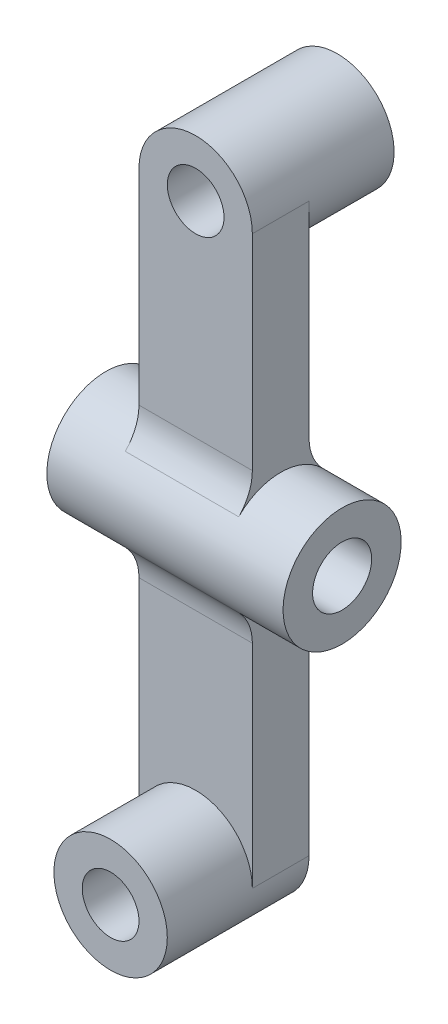
ISO-10303-21;
HEADER;
FILE_DESCRIPTION(('STEP AP214'),'2;1');
FILE_NAME('part.step','',(''),(''),'','','');
FILE_SCHEMA(('AUTOMOTIVE_DESIGN { 1 0 10303 214 1 1 1 1 }'));
ENDSEC;
DATA;
#1=APPLICATION_CONTEXT('core data for automotive mechanical design processes');
#2=APPLICATION_PROTOCOL_DEFINITION('international standard','automotive_design',2000,#1);
#3=PRODUCT_CONTEXT('',#1,'mechanical');
#4=PRODUCT('Part','Part','',(#3));
#5=PRODUCT_RELATED_PRODUCT_CATEGORY('part','',(#4));
#6=PRODUCT_DEFINITION_FORMATION('','',#4);
#7=PRODUCT_DEFINITION_CONTEXT('part definition',#1,'design');
#8=PRODUCT_DEFINITION('design','',#6,#7);
#9=PRODUCT_DEFINITION_SHAPE('','',#8);
#10=(LENGTH_UNIT() NAMED_UNIT(*) SI_UNIT(.MILLI.,.METRE.));
#11=(NAMED_UNIT(*) PLANE_ANGLE_UNIT() SI_UNIT($,.RADIAN.));
#12=(NAMED_UNIT(*) SI_UNIT($,.STERADIAN.) SOLID_ANGLE_UNIT());
#13=UNCERTAINTY_MEASURE_WITH_UNIT(LENGTH_MEASURE(1.E-05),#10,'distance_accuracy_value','');
#14=(GEOMETRIC_REPRESENTATION_CONTEXT(3) GLOBAL_UNCERTAINTY_ASSIGNED_CONTEXT((#13)) GLOBAL_UNIT_ASSIGNED_CONTEXT((#10,
#11,#12)) REPRESENTATION_CONTEXT('',''));
#15=CARTESIAN_POINT('',(0.,0.,0.));
#16=DIRECTION('',(0.,0.,1.));
#17=DIRECTION('',(1.,0.,0.));
#18=AXIS2_PLACEMENT_3D('',#15,#16,#17);
#19=CARTESIAN_POINT('',(-12.,59.225806451613,12.));
#20=DIRECTION('',(1.,0.,0.));
#21=DIRECTION('',(0.,1.,0.));
#22=AXIS2_PLACEMENT_3D('',#19,#20,#21);
#23=PLANE('',#22);
#24=CARTESIAN_POINT('',(-12.,0.,6.));
#25=DIRECTION('',(1.,0.,0.));
#26=DIRECTION('',(0.,1.,0.));
#27=AXIS2_PLACEMENT_3D('',#24,#25,#26);
#28=CIRCLE('',#27,12.5);
#29=CARTESIAN_POINT('',(-12.,-8.78849556642021,-2.88888888888889));
#30=VERTEX_POINT('',#29);
#31=CARTESIAN_POINT('',(-12.,-8.78849556642021,14.8888888888889));
#32=VERTEX_POINT('',#31);
#33=EDGE_CURVE('E229',#30,#32,#28,.F.);
#34=ORIENTED_EDGE('',*,*,#33,.F.);
#35=CARTESIAN_POINT('',(-12.,-15.8192920195564,-10.));
#36=DIRECTION('',(1.,0.,0.));
#37=DIRECTION('',(0.,1.,0.));
#38=AXIS2_PLACEMENT_3D('',#35,#36,#37);
#39=CIRCLE('',#38,10.);
#40=CARTESIAN_POINT('',(-12.,-15.8192920195564,0.));
#41=VERTEX_POINT('',#40);
#42=EDGE_CURVE('E211',#30,#41,#39,.T.);
#43=ORIENTED_EDGE('',*,*,#42,.T.);
#44=DIRECTION('',(0.,-1.,0.));
#45=VECTOR('',#44,1.);
#46=CARTESIAN_POINT('',(-12.,59.225806451613,0.));
#47=LINE('',#46,#45);
#48=CARTESIAN_POINT('',(-12.,-60.774193548387,0.));
#49=VERTEX_POINT('',#48);
#50=EDGE_CURVE('E144',#41,#49,#47,.T.);
#51=ORIENTED_EDGE('',*,*,#50,.T.);
#52=DIRECTION('',(0.,0.,-1.));
#53=VECTOR('',#52,1.);
#54=CARTESIAN_POINT('',(-12.,-60.774193548387,12.));
#55=LINE('',#54,#53);
#56=CARTESIAN_POINT('',(-12.,-60.774193548387,12.));
#57=VERTEX_POINT('',#56);
#58=EDGE_CURVE('E138',#57,#49,#55,.T.);
#59=ORIENTED_EDGE('',*,*,#58,.F.);
#60=DIRECTION('',(0.,-1.,0.));
#61=VECTOR('',#60,1.);
#62=CARTESIAN_POINT('',(-12.,59.225806451613,12.));
#63=LINE('',#62,#61);
#64=CARTESIAN_POINT('',(-12.,-15.8192920195564,12.));
#65=VERTEX_POINT('',#64);
#66=EDGE_CURVE('E167',#65,#57,#63,.T.);
#67=ORIENTED_EDGE('',*,*,#66,.F.);
#68=CARTESIAN_POINT('',(-12.,-15.8192920195564,22.));
#69=DIRECTION('',(1.,0.,0.));
#70=DIRECTION('',(0.,1.,0.));
#71=AXIS2_PLACEMENT_3D('',#68,#69,#70);
#72=CIRCLE('',#71,10.);
#73=EDGE_CURVE('E206',#65,#32,#72,.T.);
#74=ORIENTED_EDGE('',*,*,#73,.T.);
#75=EDGE_LOOP('',(#34,#43,#51,#59,#67,#74));
#76=FACE_BOUND('',#75,.T.);
#77=ADVANCED_FACE('F38',(#76),#23,.F.);
#78=CARTESIAN_POINT('',(0.,59.225806451613,12.));
#79=DIRECTION('',(0.,0.,1.));
#80=DIRECTION('',(1.,0.,0.));
#81=AXIS2_PLACEMENT_3D('',#78,#79,#80);
#82=PLANE('',#81);
#83=DIRECTION('',(0.,1.,0.));
#84=VECTOR('',#83,1.);
#85=CARTESIAN_POINT('',(12.,59.225806451613,12.));
#86=LINE('',#85,#84);
#87=CARTESIAN_POINT('',(12.,-60.774193548387,12.));
#88=VERTEX_POINT('',#87);
#89=CARTESIAN_POINT('',(12.,-15.8192920195564,12.));
#90=VERTEX_POINT('',#89);
#91=EDGE_CURVE('E171',#88,#90,#86,.T.);
#92=ORIENTED_EDGE('',*,*,#91,.T.);
#93=DIRECTION('',(1.,0.,0.));
#94=VECTOR('',#93,1.);
#95=CARTESIAN_POINT('',(0.,-15.8192920195564,12.));
#96=LINE('',#95,#94);
#97=EDGE_CURVE('E195',#90,#65,#96,.F.);
#98=ORIENTED_EDGE('',*,*,#97,.T.);
#99=ORIENTED_EDGE('',*,*,#66,.T.);
#100=CARTESIAN_POINT('',(0.,-60.774193548387,12.));
#101=DIRECTION('',(0.,0.,1.));
#102=DIRECTION('',(1.,0.,0.));
#103=AXIS2_PLACEMENT_3D('',#100,#101,#102);
#104=CIRCLE('',#103,12.);
#105=EDGE_CURVE('E162',#88,#57,#104,.T.);
#106=ORIENTED_EDGE('',*,*,#105,.F.);
#107=EDGE_LOOP('',(#92,#98,#99,#106));
#108=FACE_BOUND('',#107,.T.);
#109=ADVANCED_FACE('F280',(#108),#82,.T.);
#110=CARTESIAN_POINT('',(0.,59.225806451613,0.));
#111=DIRECTION('',(0.,0.,1.));
#112=DIRECTION('',(1.,0.,0.));
#113=AXIS2_PLACEMENT_3D('',#110,#111,#112);
#114=PLANE('',#113);
#115=CARTESIAN_POINT('',(0.,-60.774193548387,0.));
#116=DIRECTION('',(0.,0.,1.));
#117=DIRECTION('',(1.,0.,0.));
#118=AXIS2_PLACEMENT_3D('',#115,#116,#117);
#119=CIRCLE('',#118,6.);
#120=CARTESIAN_POINT('',(6.,-60.774193548387,0.));
#121=VERTEX_POINT('',#120);
#122=EDGE_CURVE('E253',#121,#121,#119,.T.);
#123=ORIENTED_EDGE('',*,*,#122,.T.);
#124=EDGE_LOOP('',(#123));
#125=FACE_BOUND('',#124,.T.);
#126=ORIENTED_EDGE('',*,*,#50,.F.);
#127=DIRECTION('',(-1.,0.,0.));
#128=VECTOR('',#127,1.);
#129=CARTESIAN_POINT('',(12.,-15.8192920195564,0.));
#130=LINE('',#129,#128);
#131=CARTESIAN_POINT('',(12.,-15.8192920195564,0.));
#132=VERTEX_POINT('',#131);
#133=EDGE_CURVE('E198',#41,#132,#130,.F.);
#134=ORIENTED_EDGE('',*,*,#133,.T.);
#135=DIRECTION('',(0.,1.,0.));
#136=VECTOR('',#135,1.);
#137=CARTESIAN_POINT('',(12.,59.225806451613,0.));
#138=LINE('',#137,#136);
#139=CARTESIAN_POINT('',(12.,-60.774193548387,0.));
#140=VERTEX_POINT('',#139);
#141=EDGE_CURVE('E168',#140,#132,#138,.T.);
#142=ORIENTED_EDGE('',*,*,#141,.F.);
#143=CARTESIAN_POINT('',(0.,-60.774193548387,0.));
#144=DIRECTION('',(0.,0.,1.));
#145=DIRECTION('',(1.,0.,0.));
#146=AXIS2_PLACEMENT_3D('',#143,#144,#145);
#147=CIRCLE('',#146,12.);
#148=EDGE_CURVE('E143',#49,#140,#147,.T.);
#149=ORIENTED_EDGE('',*,*,#148,.F.);
#150=EDGE_LOOP('',(#126,#134,#142,#149));
#151=FACE_BOUND('',#150,.T.);
#152=ADVANCED_FACE('F271',(#125,#151),#114,.F.);
#153=CARTESIAN_POINT('',(0.,-60.774193548387,12.));
#154=DIRECTION('',(0.,0.,-1.));
#155=DIRECTION('',(-1.,0.,0.));
#156=AXIS2_PLACEMENT_3D('',#153,#154,#155);
#157=CYLINDRICAL_SURFACE('',#156,12.);
#158=ORIENTED_EDGE('',*,*,#148,.T.);
#159=DIRECTION('',(0.,0.,-1.));
#160=VECTOR('',#159,1.);
#161=CARTESIAN_POINT('',(12.,-60.774193548387,12.));
#162=LINE('',#161,#160);
#163=EDGE_CURVE('E179',#88,#140,#162,.T.);
#164=ORIENTED_EDGE('',*,*,#163,.F.);
#165=ORIENTED_EDGE('',*,*,#105,.T.);
#166=ORIENTED_EDGE('',*,*,#58,.T.);
#167=EDGE_LOOP('',(#158,#164,#165,#166));
#168=FACE_BOUND('',#167,.T.);
#169=CARTESIAN_POINT('',(0.,-60.774193548387,30.));
#170=DIRECTION('',(0.,0.,1.));
#171=DIRECTION('',(1.,0.,0.));
#172=AXIS2_PLACEMENT_3D('',#169,#170,#171);
#173=CIRCLE('',#172,12.);
#174=CARTESIAN_POINT('',(12.,-60.774193548387,30.));
#175=VERTEX_POINT('',#174);
#176=EDGE_CURVE('E159',#175,#175,#173,.T.);
#177=ORIENTED_EDGE('',*,*,#176,.F.);
#178=EDGE_LOOP('',(#177));
#179=FACE_BOUND('',#178,.T.);
#180=ADVANCED_FACE('F269',(#168,#179),#157,.T.);
#181=CARTESIAN_POINT('',(12.,59.225806451613,12.));
#182=DIRECTION('',(-1.,0.,0.));
#183=DIRECTION('',(0.,-1.,0.));
#184=AXIS2_PLACEMENT_3D('',#181,#182,#183);
#185=PLANE('',#184);
#186=CARTESIAN_POINT('',(12.,0.,6.));
#187=DIRECTION('',(-1.,0.,0.));
#188=DIRECTION('',(0.,-1.,0.));
#189=AXIS2_PLACEMENT_3D('',#186,#187,#188);
#190=CIRCLE('',#189,12.5);
#191=CARTESIAN_POINT('',(12.,-8.78849556642021,14.8888888888889));
#192=VERTEX_POINT('',#191);
#193=CARTESIAN_POINT('',(12.,-8.78849556642021,-2.88888888888889));
#194=VERTEX_POINT('',#193);
#195=EDGE_CURVE('E220',#192,#194,#190,.F.);
#196=ORIENTED_EDGE('',*,*,#195,.F.);
#197=CARTESIAN_POINT('',(12.,-15.8192920195564,22.));
#198=DIRECTION('',(-1.,0.,0.));
#199=DIRECTION('',(0.,-1.,0.));
#200=AXIS2_PLACEMENT_3D('',#197,#198,#199);
#201=CIRCLE('',#200,10.);
#202=EDGE_CURVE('E209',#192,#90,#201,.T.);
#203=ORIENTED_EDGE('',*,*,#202,.T.);
#204=ORIENTED_EDGE('',*,*,#91,.F.);
#205=ORIENTED_EDGE('',*,*,#163,.T.);
#206=ORIENTED_EDGE('',*,*,#141,.T.);
#207=CARTESIAN_POINT('',(12.,-15.8192920195564,-10.));
#208=DIRECTION('',(-1.,0.,0.));
#209=DIRECTION('',(0.,-1.,0.));
#210=AXIS2_PLACEMENT_3D('',#207,#208,#209);
#211=CIRCLE('',#210,10.);
#212=EDGE_CURVE('E213',#132,#194,#211,.T.);
#213=ORIENTED_EDGE('',*,*,#212,.T.);
#214=EDGE_LOOP('',(#196,#203,#204,#205,#206,#213));
#215=FACE_BOUND('',#214,.T.);
#216=ADVANCED_FACE('F219',(#215),#185,.F.);
#217=CARTESIAN_POINT('',(0.,0.,30.));
#218=DIRECTION('',(0.,0.,1.));
#219=DIRECTION('',(1.,0.,0.));
#220=AXIS2_PLACEMENT_3D('',#217,#218,#219);
#221=PLANE('',#220);
#222=CARTESIAN_POINT('',(0.,-60.774193548387,30.));
#223=DIRECTION('',(0.,0.,1.));
#224=DIRECTION('',(1.,0.,0.));
#225=AXIS2_PLACEMENT_3D('',#222,#223,#224);
#226=CIRCLE('',#225,6.);
#227=CARTESIAN_POINT('',(6.,-60.774193548387,30.));
#228=VERTEX_POINT('',#227);
#229=EDGE_CURVE('E256',#228,#228,#226,.T.);
#230=ORIENTED_EDGE('',*,*,#229,.F.);
#231=EDGE_LOOP('',(#230));
#232=FACE_BOUND('',#231,.T.);
#233=ORIENTED_EDGE('',*,*,#176,.T.);
#234=EDGE_LOOP('',(#233));
#235=FACE_BOUND('',#234,.T.);
#236=ADVANCED_FACE('F263',(#232,#235),#221,.T.);
#237=CARTESIAN_POINT('',(-25.,0.,6.));
#238=DIRECTION('',(1.,0.,0.));
#239=DIRECTION('',(0.,1.,0.));
#240=AXIS2_PLACEMENT_3D('',#237,#238,#239);
#241=CYLINDRICAL_SURFACE('',#240,12.5);
#242=ORIENTED_EDGE('',*,*,#33,.T.);
#243=DIRECTION('',(1.,0.,0.));
#244=VECTOR('',#243,1.);
#245=CARTESIAN_POINT('',(-25.,-8.78849556642021,14.8888888888889));
#246=LINE('',#245,#244);
#247=EDGE_CURVE('E189',#32,#192,#246,.T.);
#248=ORIENTED_EDGE('',*,*,#247,.T.);
#249=ORIENTED_EDGE('',*,*,#195,.T.);
#250=DIRECTION('',(1.,0.,0.));
#251=VECTOR('',#250,1.);
#252=CARTESIAN_POINT('',(-25.,-8.78849556642021,-2.88888888888889));
#253=LINE('',#252,#251);
#254=EDGE_CURVE('E186',#194,#30,#253,.F.);
#255=ORIENTED_EDGE('',*,*,#254,.T.);
#256=EDGE_LOOP('',(#242,#248,#249,#255));
#257=FACE_BOUND('',#256,.T.);
#258=CARTESIAN_POINT('',(12.,8.78849556642021,-2.88888888888889));
#259=VERTEX_POINT('',#258);
#260=CARTESIAN_POINT('',(12.,8.78849556642021,14.8888888888889));
#261=VERTEX_POINT('',#260);
#262=EDGE_CURVE('E234',#259,#261,#190,.F.);
#263=ORIENTED_EDGE('',*,*,#262,.T.);
#264=DIRECTION('',(1.,0.,0.));
#265=VECTOR('',#264,1.);
#266=CARTESIAN_POINT('',(-25.,8.7884955664202,14.8888888888889));
#267=LINE('',#266,#265);
#268=CARTESIAN_POINT('',(-12.,8.78849556642021,14.8888888888889));
#269=VERTEX_POINT('',#268);
#270=EDGE_CURVE('E192',#261,#269,#267,.F.);
#271=ORIENTED_EDGE('',*,*,#270,.T.);
#272=CARTESIAN_POINT('',(-12.,8.78849556642021,-2.88888888888889));
#273=VERTEX_POINT('',#272);
#274=EDGE_CURVE('E232',#269,#273,#28,.F.);
#275=ORIENTED_EDGE('',*,*,#274,.T.);
#276=DIRECTION('',(1.,0.,0.));
#277=VECTOR('',#276,1.);
#278=CARTESIAN_POINT('',(-25.,8.7884955664202,-2.88888888888889));
#279=LINE('',#278,#277);
#280=EDGE_CURVE('E153',#273,#259,#279,.T.);
#281=ORIENTED_EDGE('',*,*,#280,.T.);
#282=EDGE_LOOP('',(#263,#271,#275,#281));
#283=FACE_BOUND('',#282,.T.);
#284=CARTESIAN_POINT('',(-25.,0.,6.));
#285=DIRECTION('',(-1.,0.,0.));
#286=DIRECTION('',(0.,-1.,0.));
#287=AXIS2_PLACEMENT_3D('',#284,#285,#286);
#288=CIRCLE('',#287,12.5);
#289=CARTESIAN_POINT('',(-25.,-12.5,6.));
#290=VERTEX_POINT('',#289);
#291=EDGE_CURVE('E236',#290,#290,#288,.T.);
#292=ORIENTED_EDGE('',*,*,#291,.F.);
#293=EDGE_LOOP('',(#292));
#294=FACE_BOUND('',#293,.T.);
#295=CARTESIAN_POINT('',(25.,0.,6.));
#296=DIRECTION('',(-1.,0.,0.));
#297=DIRECTION('',(0.,-1.,0.));
#298=AXIS2_PLACEMENT_3D('',#295,#296,#297);
#299=CIRCLE('',#298,12.5);
#300=CARTESIAN_POINT('',(25.,-12.5,6.));
#301=VERTEX_POINT('',#300);
#302=EDGE_CURVE('E238',#301,#301,#299,.T.);
#303=ORIENTED_EDGE('',*,*,#302,.T.);
#304=EDGE_LOOP('',(#303));
#305=FACE_BOUND('',#304,.T.);
#306=ADVANCED_FACE('F227',(#257,#283,#294,#305),#241,.T.);
#307=CARTESIAN_POINT('',(-25.,0.,6.));
#308=DIRECTION('',(-1.,0.,0.));
#309=DIRECTION('',(0.,-1.,0.));
#310=AXIS2_PLACEMENT_3D('',#307,#308,#309);
#311=PLANE('',#310);
#312=CARTESIAN_POINT('',(-25.,0.,6.));
#313=DIRECTION('',(-1.,0.,0.));
#314=DIRECTION('',(0.,-1.,0.));
#315=AXIS2_PLACEMENT_3D('',#312,#313,#314);
#316=CIRCLE('',#315,6.25);
#317=CARTESIAN_POINT('',(-25.,-6.25,6.));
#318=VERTEX_POINT('',#317);
#319=EDGE_CURVE('E245',#318,#318,#316,.T.);
#320=ORIENTED_EDGE('',*,*,#319,.F.);
#321=EDGE_LOOP('',(#320));
#322=FACE_BOUND('',#321,.T.);
#323=ORIENTED_EDGE('',*,*,#291,.T.);
#324=EDGE_LOOP('',(#323));
#325=FACE_BOUND('',#324,.T.);
#326=ADVANCED_FACE('F313',(#322,#325),#311,.T.);
#327=CARTESIAN_POINT('',(25.,0.,6.));
#328=DIRECTION('',(-1.,0.,0.));
#329=DIRECTION('',(0.,-1.,0.));
#330=AXIS2_PLACEMENT_3D('',#327,#328,#329);
#331=PLANE('',#330);
#332=CARTESIAN_POINT('',(25.,0.,6.));
#333=DIRECTION('',(-1.,0.,0.));
#334=DIRECTION('',(0.,-1.,0.));
#335=AXIS2_PLACEMENT_3D('',#332,#333,#334);
#336=CIRCLE('',#335,6.25);
#337=CARTESIAN_POINT('',(25.,-6.25,6.));
#338=VERTEX_POINT('',#337);
#339=EDGE_CURVE('E243',#338,#338,#336,.T.);
#340=ORIENTED_EDGE('',*,*,#339,.T.);
#341=EDGE_LOOP('',(#340));
#342=FACE_BOUND('',#341,.T.);
#343=ORIENTED_EDGE('',*,*,#302,.F.);
#344=EDGE_LOOP('',(#343));
#345=FACE_BOUND('',#344,.T.);
#346=ADVANCED_FACE('F309',(#342,#345),#331,.F.);
#347=CARTESIAN_POINT('',(0.,0.,-18.));
#348=DIRECTION('',(0.,0.,-1.));
#349=DIRECTION('',(-1.,0.,0.));
#350=AXIS2_PLACEMENT_3D('',#347,#348,#349);
#351=PLANE('',#350);
#352=CARTESIAN_POINT('',(0.,59.225806451613,-18.));
#353=DIRECTION('',(0.,0.,-1.));
#354=DIRECTION('',(-1.,0.,0.));
#355=AXIS2_PLACEMENT_3D('',#352,#353,#354);
#356=CIRCLE('',#355,6.);
#357=CARTESIAN_POINT('',(-6.,59.225806451613,-18.));
#358=VERTEX_POINT('',#357);
#359=EDGE_CURVE('E250',#358,#358,#356,.T.);
#360=ORIENTED_EDGE('',*,*,#359,.F.);
#361=EDGE_LOOP('',(#360));
#362=FACE_BOUND('',#361,.T.);
#363=CARTESIAN_POINT('',(0.,59.225806451613,-18.));
#364=DIRECTION('',(0.,0.,-1.));
#365=DIRECTION('',(-1.,0.,0.));
#366=AXIS2_PLACEMENT_3D('',#363,#364,#365);
#367=CIRCLE('',#366,12.);
#368=CARTESIAN_POINT('',(-12.,59.225806451613,-18.));
#369=VERTEX_POINT('',#368);
#370=EDGE_CURVE('E157',#369,#369,#367,.T.);
#371=ORIENTED_EDGE('',*,*,#370,.T.);
#372=EDGE_LOOP('',(#371));
#373=FACE_BOUND('',#372,.T.);
#374=ADVANCED_FACE('F306',(#362,#373),#351,.T.);
#375=CARTESIAN_POINT('',(0.,59.225806451613,12.));
#376=DIRECTION('',(0.,0.,-1.));
#377=DIRECTION('',(-1.,0.,0.));
#378=AXIS2_PLACEMENT_3D('',#375,#376,#377);
#379=CYLINDRICAL_SURFACE('',#378,12.);
#380=DIRECTION('',(0.,0.,-1.));
#381=VECTOR('',#380,1.);
#382=CARTESIAN_POINT('',(12.,59.225806451613,12.));
#383=LINE('',#382,#381);
#384=CARTESIAN_POINT('',(12.,59.225806451613,12.));
#385=VERTEX_POINT('',#384);
#386=CARTESIAN_POINT('',(12.,59.225806451613,0.));
#387=VERTEX_POINT('',#386);
#388=EDGE_CURVE('E149',#385,#387,#383,.T.);
#389=ORIENTED_EDGE('',*,*,#388,.T.);
#390=CARTESIAN_POINT('',(0.,59.225806451613,0.));
#391=DIRECTION('',(0.,0.,-1.));
#392=DIRECTION('',(-1.,0.,0.));
#393=AXIS2_PLACEMENT_3D('',#390,#391,#392);
#394=CIRCLE('',#393,12.);
#395=CARTESIAN_POINT('',(-12.,59.225806451613,0.));
#396=VERTEX_POINT('',#395);
#397=EDGE_CURVE('E137',#387,#396,#394,.T.);
#398=ORIENTED_EDGE('',*,*,#397,.T.);
#399=DIRECTION('',(0.,0.,-1.));
#400=VECTOR('',#399,1.);
#401=CARTESIAN_POINT('',(-12.,59.225806451613,12.));
#402=LINE('',#401,#400);
#403=CARTESIAN_POINT('',(-12.,59.225806451613,12.));
#404=VERTEX_POINT('',#403);
#405=EDGE_CURVE('E127',#404,#396,#402,.T.);
#406=ORIENTED_EDGE('',*,*,#405,.F.);
#407=CARTESIAN_POINT('',(0.,59.225806451613,12.));
#408=DIRECTION('',(0.,0.,1.));
#409=DIRECTION('',(1.,0.,0.));
#410=AXIS2_PLACEMENT_3D('',#407,#408,#409);
#411=CIRCLE('',#410,12.);
#412=EDGE_CURVE('E165',#385,#404,#411,.T.);
#413=ORIENTED_EDGE('',*,*,#412,.F.);
#414=EDGE_LOOP('',(#389,#398,#406,#413));
#415=FACE_BOUND('',#414,.T.);
#416=ORIENTED_EDGE('',*,*,#370,.F.);
#417=EDGE_LOOP('',(#416));
#418=FACE_BOUND('',#417,.T.);
#419=ADVANCED_FACE('F146',(#415,#418),#379,.T.);
#420=CARTESIAN_POINT('',(0.,59.225806451613,12.));
#421=DIRECTION('',(0.,0.,1.));
#422=DIRECTION('',(1.,0.,0.));
#423=AXIS2_PLACEMENT_3D('',#420,#421,#422);
#424=CIRCLE('',#423,6.);
#425=CARTESIAN_POINT('',(6.,59.225806451613,12.));
#426=VERTEX_POINT('',#425);
#427=EDGE_CURVE('E42',#426,#426,#424,.T.);
#428=ORIENTED_EDGE('',*,*,#427,.F.);
#429=EDGE_LOOP('',(#428));
#430=FACE_BOUND('',#429,.T.);
#431=CARTESIAN_POINT('',(-12.,15.8192920195564,12.));
#432=VERTEX_POINT('',#431);
#433=EDGE_CURVE('E132',#404,#432,#63,.T.);
#434=ORIENTED_EDGE('',*,*,#433,.T.);
#435=DIRECTION('',(1.,0.,0.));
#436=VECTOR('',#435,1.);
#437=CARTESIAN_POINT('',(0.,15.8192920195564,12.));
#438=LINE('',#437,#436);
#439=CARTESIAN_POINT('',(12.,15.8192920195564,12.));
#440=VERTEX_POINT('',#439);
#441=EDGE_CURVE('E150',#432,#440,#438,.T.);
#442=ORIENTED_EDGE('',*,*,#441,.T.);
#443=EDGE_CURVE('E170',#440,#385,#86,.T.);
#444=ORIENTED_EDGE('',*,*,#443,.T.);
#445=ORIENTED_EDGE('',*,*,#412,.T.);
#446=EDGE_LOOP('',(#434,#442,#444,#445));
#447=FACE_BOUND('',#446,.T.);
#448=ADVANCED_FACE('F291',(#430,#447),#82,.T.);
#449=CARTESIAN_POINT('',(12.,15.8192920195564,0.));
#450=VERTEX_POINT('',#449);
#451=EDGE_CURVE('E175',#450,#387,#138,.T.);
#452=ORIENTED_EDGE('',*,*,#451,.F.);
#453=DIRECTION('',(-1.,0.,0.));
#454=VECTOR('',#453,1.);
#455=CARTESIAN_POINT('',(-12.,15.8192920195564,0.));
#456=LINE('',#455,#454);
#457=CARTESIAN_POINT('',(-12.,15.8192920195564,0.));
#458=VERTEX_POINT('',#457);
#459=EDGE_CURVE('E60',#450,#458,#456,.T.);
#460=ORIENTED_EDGE('',*,*,#459,.T.);
#461=EDGE_CURVE('E129',#396,#458,#47,.T.);
#462=ORIENTED_EDGE('',*,*,#461,.F.);
#463=ORIENTED_EDGE('',*,*,#397,.F.);
#464=EDGE_LOOP('',(#452,#460,#462,#463));
#465=FACE_BOUND('',#464,.T.);
#466=ADVANCED_FACE('F141',(#465),#114,.F.);
#467=ORIENTED_EDGE('',*,*,#262,.F.);
#468=CARTESIAN_POINT('',(12.,15.8192920195564,-10.));
#469=DIRECTION('',(-1.,0.,0.));
#470=DIRECTION('',(0.,-1.,0.));
#471=AXIS2_PLACEMENT_3D('',#468,#469,#470);
#472=CIRCLE('',#471,10.);
#473=EDGE_CURVE('E47',#259,#450,#472,.T.);
#474=ORIENTED_EDGE('',*,*,#473,.T.);
#475=ORIENTED_EDGE('',*,*,#451,.T.);
#476=ORIENTED_EDGE('',*,*,#388,.F.);
#477=ORIENTED_EDGE('',*,*,#443,.F.);
#478=CARTESIAN_POINT('',(12.,15.8192920195564,22.));
#479=DIRECTION('',(-1.,0.,0.));
#480=DIRECTION('',(0.,-1.,0.));
#481=AXIS2_PLACEMENT_3D('',#478,#479,#480);
#482=CIRCLE('',#481,10.);
#483=EDGE_CURVE('E201',#440,#261,#482,.T.);
#484=ORIENTED_EDGE('',*,*,#483,.T.);
#485=EDGE_LOOP('',(#467,#474,#475,#476,#477,#484));
#486=FACE_BOUND('',#485,.T.);
#487=ADVANCED_FACE('F279',(#486),#185,.F.);
#488=ORIENTED_EDGE('',*,*,#274,.F.);
#489=CARTESIAN_POINT('',(-12.,15.8192920195564,22.));
#490=DIRECTION('',(1.,0.,0.));
#491=DIRECTION('',(0.,1.,0.));
#492=AXIS2_PLACEMENT_3D('',#489,#490,#491);
#493=CIRCLE('',#492,10.);
#494=EDGE_CURVE('E204',#269,#432,#493,.T.);
#495=ORIENTED_EDGE('',*,*,#494,.T.);
#496=ORIENTED_EDGE('',*,*,#433,.F.);
#497=ORIENTED_EDGE('',*,*,#405,.T.);
#498=ORIENTED_EDGE('',*,*,#461,.T.);
#499=CARTESIAN_POINT('',(-12.,15.8192920195564,-10.));
#500=DIRECTION('',(1.,0.,0.));
#501=DIRECTION('',(0.,1.,0.));
#502=AXIS2_PLACEMENT_3D('',#499,#500,#501);
#503=CIRCLE('',#502,10.);
#504=EDGE_CURVE('E11',#458,#273,#503,.T.);
#505=ORIENTED_EDGE('',*,*,#504,.T.);
#506=EDGE_LOOP('',(#488,#495,#496,#497,#498,#505));
#507=FACE_BOUND('',#506,.T.);
#508=ADVANCED_FACE('F128',(#507),#23,.F.);
#509=CARTESIAN_POINT('',(25.,0.,6.));
#510=DIRECTION('',(-1.,0.,0.));
#511=DIRECTION('',(0.,-1.,0.));
#512=AXIS2_PLACEMENT_3D('',#509,#510,#511);
#513=CYLINDRICAL_SURFACE('',#512,6.25);
#514=ORIENTED_EDGE('',*,*,#339,.F.);
#515=EDGE_LOOP('',(#514));
#516=FACE_BOUND('',#515,.T.);
#517=ORIENTED_EDGE('',*,*,#319,.T.);
#518=EDGE_LOOP('',(#517));
#519=FACE_BOUND('',#518,.T.);
#520=ADVANCED_FACE('F294',(#516,#519),#513,.F.);
#521=CARTESIAN_POINT('',(-25.,15.8192920195564,22.));
#522=DIRECTION('',(1.,0.,0.));
#523=DIRECTION('',(0.,1.,0.));
#524=AXIS2_PLACEMENT_3D('',#521,#522,#523);
#525=CYLINDRICAL_SURFACE('',#524,10.);
#526=ORIENTED_EDGE('',*,*,#494,.F.);
#527=ORIENTED_EDGE('',*,*,#270,.F.);
#528=ORIENTED_EDGE('',*,*,#483,.F.);
#529=ORIENTED_EDGE('',*,*,#441,.F.);
#530=EDGE_LOOP('',(#526,#527,#528,#529));
#531=FACE_BOUND('',#530,.T.);
#532=ADVANCED_FACE('F299',(#531),#525,.F.);
#533=CARTESIAN_POINT('',(-25.,-15.8192920195564,22.));
#534=DIRECTION('',(1.,0.,0.));
#535=DIRECTION('',(0.,1.,0.));
#536=AXIS2_PLACEMENT_3D('',#533,#534,#535);
#537=CYLINDRICAL_SURFACE('',#536,10.);
#538=ORIENTED_EDGE('',*,*,#202,.F.);
#539=ORIENTED_EDGE('',*,*,#247,.F.);
#540=ORIENTED_EDGE('',*,*,#73,.F.);
#541=ORIENTED_EDGE('',*,*,#97,.F.);
#542=EDGE_LOOP('',(#538,#539,#540,#541));
#543=FACE_BOUND('',#542,.T.);
#544=ADVANCED_FACE('F347',(#543),#537,.F.);
#545=CARTESIAN_POINT('',(-25.,-15.8192920195564,-10.));
#546=DIRECTION('',(1.,0.,0.));
#547=DIRECTION('',(0.,1.,0.));
#548=AXIS2_PLACEMENT_3D('',#545,#546,#547);
#549=CYLINDRICAL_SURFACE('',#548,10.);
#550=ORIENTED_EDGE('',*,*,#212,.F.);
#551=ORIENTED_EDGE('',*,*,#133,.F.);
#552=ORIENTED_EDGE('',*,*,#42,.F.);
#553=ORIENTED_EDGE('',*,*,#254,.F.);
#554=EDGE_LOOP('',(#550,#551,#552,#553));
#555=FACE_BOUND('',#554,.T.);
#556=ADVANCED_FACE('F225',(#555),#549,.F.);
#557=CARTESIAN_POINT('',(-25.,15.8192920195564,-10.));
#558=DIRECTION('',(1.,0.,0.));
#559=DIRECTION('',(0.,1.,0.));
#560=AXIS2_PLACEMENT_3D('',#557,#558,#559);
#561=CYLINDRICAL_SURFACE('',#560,10.);
#562=ORIENTED_EDGE('',*,*,#504,.F.);
#563=ORIENTED_EDGE('',*,*,#459,.F.);
#564=ORIENTED_EDGE('',*,*,#473,.F.);
#565=ORIENTED_EDGE('',*,*,#280,.F.);
#566=EDGE_LOOP('',(#562,#563,#564,#565));
#567=FACE_BOUND('',#566,.T.);
#568=ADVANCED_FACE('F40',(#567),#561,.F.);
#569=CARTESIAN_POINT('',(0.,59.225806451613,30.));
#570=DIRECTION('',(0.,0.,-1.));
#571=DIRECTION('',(-1.,0.,0.));
#572=AXIS2_PLACEMENT_3D('',#569,#570,#571);
#573=CYLINDRICAL_SURFACE('',#572,6.);
#574=ORIENTED_EDGE('',*,*,#427,.T.);
#575=EDGE_LOOP('',(#574));
#576=FACE_BOUND('',#575,.T.);
#577=ORIENTED_EDGE('',*,*,#359,.T.);
#578=EDGE_LOOP('',(#577));
#579=FACE_BOUND('',#578,.T.);
#580=ADVANCED_FACE('F320',(#576,#579),#573,.F.);
#581=CARTESIAN_POINT('',(0.,-60.774193548387,-18.));
#582=DIRECTION('',(0.,0.,1.));
#583=DIRECTION('',(1.,0.,0.));
#584=AXIS2_PLACEMENT_3D('',#581,#582,#583);
#585=CYLINDRICAL_SURFACE('',#584,6.);
#586=ORIENTED_EDGE('',*,*,#229,.T.);
#587=EDGE_LOOP('',(#586));
#588=FACE_BOUND('',#587,.T.);
#589=ORIENTED_EDGE('',*,*,#122,.F.);
#590=EDGE_LOOP('',(#589));
#591=FACE_BOUND('',#590,.T.);
#592=ADVANCED_FACE('F260',(#588,#591),#585,.F.);
#593=CLOSED_SHELL('',(#77,#109,#152,#180,#216,#236,#306,#326,#346,#374,#419,#448,#466,#487,#508,
#520,#532,#544,#556,#568,#580,#592));
#594=MANIFOLD_SOLID_BREP('B2',#593);
#595=ADVANCED_BREP_SHAPE_REPRESENTATION('',(#18,#594),#14);
#596=SHAPE_DEFINITION_REPRESENTATION(#9,#595);
ENDSEC;
END-ISO-10303-21;
